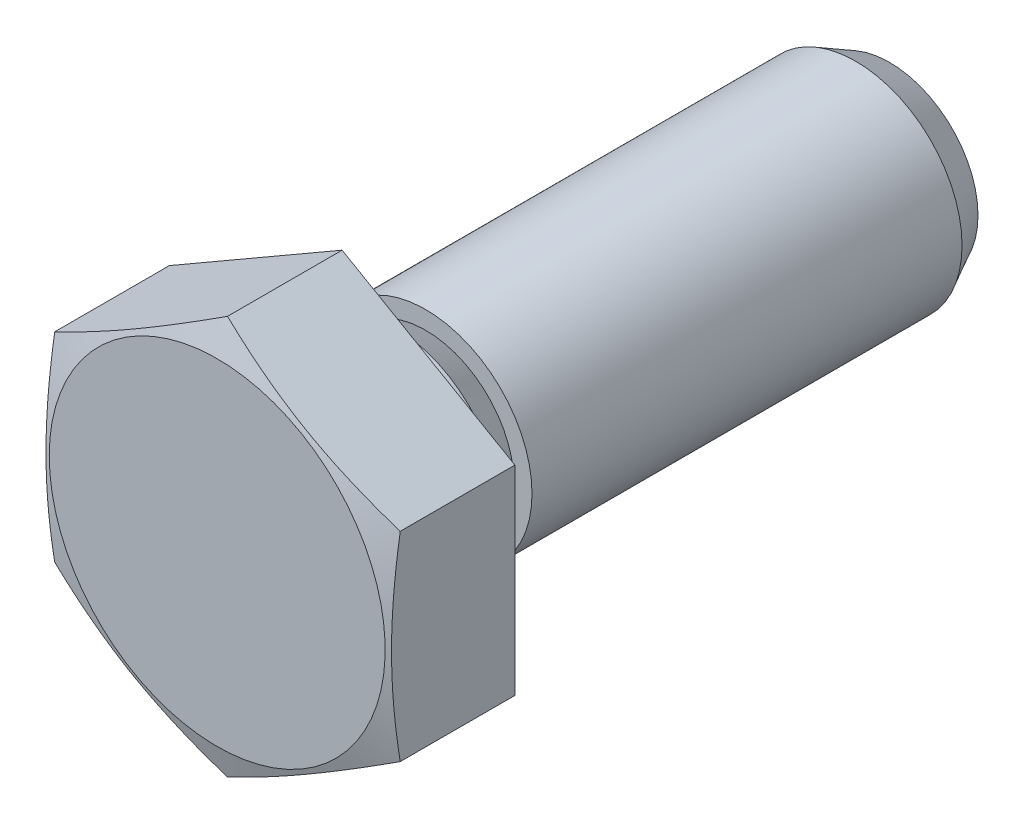
ISO-10303-21;
HEADER;
FILE_DESCRIPTION(('STEP AP214'),'2;1');
FILE_NAME('part.step','',(''),(''),'','','');
FILE_SCHEMA(('AUTOMOTIVE_DESIGN { 1 0 10303 214 1 1 1 1 }'));
ENDSEC;
DATA;
#1=APPLICATION_CONTEXT('core data for automotive mechanical design processes');
#2=APPLICATION_PROTOCOL_DEFINITION('international standard','automotive_design',2000,#1);
#3=PRODUCT_CONTEXT('',#1,'mechanical');
#4=PRODUCT('Part','Part','',(#3));
#5=PRODUCT_RELATED_PRODUCT_CATEGORY('part','',(#4));
#6=PRODUCT_DEFINITION_FORMATION('','',#4);
#7=PRODUCT_DEFINITION_CONTEXT('part definition',#1,'design');
#8=PRODUCT_DEFINITION('design','',#6,#7);
#9=PRODUCT_DEFINITION_SHAPE('','',#8);
#10=(LENGTH_UNIT() NAMED_UNIT(*) SI_UNIT(.MILLI.,.METRE.));
#11=(NAMED_UNIT(*) PLANE_ANGLE_UNIT() SI_UNIT($,.RADIAN.));
#12=(NAMED_UNIT(*) SI_UNIT($,.STERADIAN.) SOLID_ANGLE_UNIT());
#13=UNCERTAINTY_MEASURE_WITH_UNIT(LENGTH_MEASURE(1.E-05),#10,'distance_accuracy_value','');
#14=(GEOMETRIC_REPRESENTATION_CONTEXT(3) GLOBAL_UNCERTAINTY_ASSIGNED_CONTEXT((#13)) GLOBAL_UNIT_ASSIGNED_CONTEXT((#10,
#11,#12)) REPRESENTATION_CONTEXT('',''));
#15=CARTESIAN_POINT('',(0.,0.,0.));
#16=DIRECTION('',(0.,0.,1.));
#17=DIRECTION('',(1.,0.,0.));
#18=AXIS2_PLACEMENT_3D('',#15,#16,#17);
#19=CARTESIAN_POINT('',(0.,0.,0.600000000000003));
#20=DIRECTION('',(0.,0.,1.));
#21=DIRECTION('',(1.,0.,0.));
#22=AXIS2_PLACEMENT_3D('',#19,#20,#21);
#23=TOROIDAL_SURFACE('',#22,5.1,0.6);
#24=CARTESIAN_POINT('',(0.,0.,0.600000000000003));
#25=DIRECTION('',(0.,0.,1.));
#26=DIRECTION('',(1.,0.,0.));
#27=AXIS2_PLACEMENT_3D('',#24,#25,#26);
#28=CIRCLE('',#27,5.7);
#29=CARTESIAN_POINT('',(5.70000000000002,0.,0.600000000000004));
#30=VERTEX_POINT('',#29);
#31=EDGE_CURVE('E11',#30,#30,#28,.T.);
#32=ORIENTED_EDGE('',*,*,#31,.F.);
#33=EDGE_LOOP('',(#32));
#34=FACE_BOUND('',#33,.T.);
#35=CARTESIAN_POINT('',(0.,0.,0.));
#36=DIRECTION('',(0.,0.,1.));
#37=DIRECTION('',(1.,0.,0.));
#38=AXIS2_PLACEMENT_3D('',#35,#36,#37);
#39=CIRCLE('',#38,5.1);
#40=CARTESIAN_POINT('',(5.10000000000002,0.,0.));
#41=VERTEX_POINT('',#40);
#42=EDGE_CURVE('E23',#41,#41,#39,.T.);
#43=ORIENTED_EDGE('',*,*,#42,.T.);
#44=EDGE_LOOP('',(#43));
#45=FACE_BOUND('',#44,.T.);
#46=ADVANCED_FACE('F16',(#34,#45),#23,.T.);
#47=CARTESIAN_POINT('',(0.,5.09999999999991,0.));
#48=DIRECTION('',(0.,0.,-1.));
#49=DIRECTION('',(-1.,0.,0.));
#50=AXIS2_PLACEMENT_3D('',#47,#48,#49);
#51=PLANE('',#50);
#52=CARTESIAN_POINT('',(0.,0.,0.));
#53=DIRECTION('',(0.,0.,1.));
#54=DIRECTION('',(1.,0.,0.));
#55=AXIS2_PLACEMENT_3D('',#52,#53,#54);
#56=CIRCLE('',#55,4.4);
#57=CARTESIAN_POINT('',(4.40000000000002,0.,0.));
#58=VERTEX_POINT('',#57);
#59=EDGE_CURVE('E117',#58,#58,#56,.T.);
#60=ORIENTED_EDGE('',*,*,#59,.T.);
#61=EDGE_LOOP('',(#60));
#62=FACE_BOUND('',#61,.T.);
#63=ORIENTED_EDGE('',*,*,#42,.F.);
#64=EDGE_LOOP('',(#63));
#65=FACE_BOUND('',#64,.T.);
#66=ADVANCED_FACE('F123',(#62,#65),#51,.T.);
#67=CARTESIAN_POINT('',(0.,0.,-0.399999999999998));
#68=DIRECTION('',(0.,0.,1.));
#69=DIRECTION('',(1.,0.,0.));
#70=AXIS2_PLACEMENT_3D('',#67,#68,#69);
#71=TOROIDAL_SURFACE('',#70,4.4,0.4);
#72=CARTESIAN_POINT('',(0.,0.,-0.399999999999998));
#73=DIRECTION('',(0.,0.,1.));
#74=DIRECTION('',(1.,0.,0.));
#75=AXIS2_PLACEMENT_3D('',#72,#73,#74);
#76=CIRCLE('',#75,4.);
#77=CARTESIAN_POINT('',(4.00000000000001,0.,-0.399999999999997));
#78=VERTEX_POINT('',#77);
#79=EDGE_CURVE('E114',#78,#78,#76,.T.);
#80=ORIENTED_EDGE('',*,*,#79,.T.);
#81=EDGE_LOOP('',(#80));
#82=FACE_BOUND('',#81,.T.);
#83=ORIENTED_EDGE('',*,*,#59,.F.);
#84=EDGE_LOOP('',(#83));
#85=FACE_BOUND('',#84,.T.);
#86=ADVANCED_FACE('F125',(#82,#85),#71,.F.);
#87=CARTESIAN_POINT('',(0.,0.,0.600000000000003));
#88=DIRECTION('',(0.,0.,1.));
#89=DIRECTION('',(1.,0.,0.));
#90=AXIS2_PLACEMENT_3D('',#87,#88,#89);
#91=CYLINDRICAL_SURFACE('',#90,4.);
#92=CARTESIAN_POINT('',(0.,0.,-1.37215937550418));
#93=DIRECTION('',(0.,0.,1.));
#94=DIRECTION('',(1.,0.,0.));
#95=AXIS2_PLACEMENT_3D('',#92,#93,#94);
#96=CIRCLE('',#95,4.);
#97=CARTESIAN_POINT('',(4.00000000000001,0.,-1.37215937550418));
#98=VERTEX_POINT('',#97);
#99=EDGE_CURVE('E111',#98,#98,#96,.T.);
#100=ORIENTED_EDGE('',*,*,#99,.T.);
#101=EDGE_LOOP('',(#100));
#102=FACE_BOUND('',#101,.T.);
#103=ORIENTED_EDGE('',*,*,#79,.F.);
#104=EDGE_LOOP('',(#103));
#105=FACE_BOUND('',#104,.T.);
#106=ADVANCED_FACE('F132',(#102,#105),#91,.T.);
#107=CARTESIAN_POINT('',(0.,0.,-1.37215937550418));
#108=DIRECTION('',(0.,0.,1.));
#109=DIRECTION('',(1.,0.,0.));
#110=AXIS2_PLACEMENT_3D('',#107,#108,#109);
#111=CONICAL_SURFACE('',#110,4.,0.523598775598299);
#112=CARTESIAN_POINT('',(0.,0.,-2.544));
#113=DIRECTION('',(0.,0.,1.));
#114=DIRECTION('',(1.,0.,0.));
#115=AXIS2_PLACEMENT_3D('',#112,#113,#114);
#116=CIRCLE('',#115,3.3234375);
#117=CARTESIAN_POINT('',(3.32343750000001,0.,-2.544));
#118=VERTEX_POINT('',#117);
#119=EDGE_CURVE('E108',#118,#118,#116,.T.);
#120=ORIENTED_EDGE('',*,*,#119,.T.);
#121=EDGE_LOOP('',(#120));
#122=FACE_BOUND('',#121,.T.);
#123=ORIENTED_EDGE('',*,*,#99,.F.);
#124=EDGE_LOOP('',(#123));
#125=FACE_BOUND('',#124,.T.);
#126=ADVANCED_FACE('F139',(#122,#125),#111,.T.);
#127=CARTESIAN_POINT('',(0.,3.32343749999991,-2.54399999999999));
#128=DIRECTION('',(0.,0.,1.));
#129=DIRECTION('',(1.,0.,0.));
#130=AXIS2_PLACEMENT_3D('',#127,#128,#129);
#131=PLANE('',#130);
#132=CARTESIAN_POINT('',(0.,0.,-2.544));
#133=DIRECTION('',(0.,0.,1.));
#134=DIRECTION('',(1.,0.,0.));
#135=AXIS2_PLACEMENT_3D('',#132,#133,#134);
#136=CIRCLE('',#135,4.);
#137=CARTESIAN_POINT('',(4.00000000000001,0.,-2.544));
#138=VERTEX_POINT('',#137);
#139=EDGE_CURVE('E105',#138,#138,#136,.T.);
#140=ORIENTED_EDGE('',*,*,#139,.T.);
#141=EDGE_LOOP('',(#140));
#142=FACE_BOUND('',#141,.T.);
#143=ORIENTED_EDGE('',*,*,#119,.F.);
#144=EDGE_LOOP('',(#143));
#145=FACE_BOUND('',#144,.T.);
#146=ADVANCED_FACE('F143',(#142,#145),#131,.T.);
#147=CARTESIAN_POINT('',(0.,0.,0.600000000000003));
#148=DIRECTION('',(0.,0.,1.));
#149=DIRECTION('',(1.,0.,0.));
#150=AXIS2_PLACEMENT_3D('',#147,#148,#149);
#151=CYLINDRICAL_SURFACE('',#150,4.);
#152=CARTESIAN_POINT('',(0.,0.,-18.7234375));
#153=DIRECTION('',(0.,0.,1.));
#154=DIRECTION('',(1.,0.,0.));
#155=AXIS2_PLACEMENT_3D('',#152,#153,#154);
#156=CIRCLE('',#155,4.);
#157=CARTESIAN_POINT('',(4.00000000000002,0.,-18.7234375));
#158=VERTEX_POINT('',#157);
#159=EDGE_CURVE('E102',#158,#158,#156,.T.);
#160=ORIENTED_EDGE('',*,*,#159,.T.);
#161=EDGE_LOOP('',(#160));
#162=FACE_BOUND('',#161,.T.);
#163=ORIENTED_EDGE('',*,*,#139,.F.);
#164=EDGE_LOOP('',(#163));
#165=FACE_BOUND('',#164,.T.);
#166=ADVANCED_FACE('F147',(#162,#165),#151,.T.);
#167=CARTESIAN_POINT('',(0.,0.,-18.7234375));
#168=DIRECTION('',(0.,0.,1.));
#169=DIRECTION('',(1.,0.,0.));
#170=AXIS2_PLACEMENT_3D('',#167,#168,#169);
#171=CONICAL_SURFACE('',#170,4.,0.487349023752149);
#172=CARTESIAN_POINT('',(0.,0.,-20.));
#173=DIRECTION('',(0.,0.,1.));
#174=DIRECTION('',(1.,0.,0.));
#175=AXIS2_PLACEMENT_3D('',#172,#173,#174);
#176=CIRCLE('',#175,3.3234375);
#177=CARTESIAN_POINT('',(3.32343750000002,0.,-20.));
#178=VERTEX_POINT('',#177);
#179=EDGE_CURVE('E99',#178,#178,#176,.T.);
#180=ORIENTED_EDGE('',*,*,#179,.T.);
#181=EDGE_LOOP('',(#180));
#182=FACE_BOUND('',#181,.T.);
#183=ORIENTED_EDGE('',*,*,#159,.F.);
#184=EDGE_LOOP('',(#183));
#185=FACE_BOUND('',#184,.T.);
#186=ADVANCED_FACE('F151',(#182,#185),#171,.T.);
#187=CARTESIAN_POINT('',(0.,3.32343749999989,-20.));
#188=DIRECTION('',(0.,0.,-1.));
#189=DIRECTION('',(-1.,0.,0.));
#190=AXIS2_PLACEMENT_3D('',#187,#188,#189);
#191=PLANE('',#190);
#192=ORIENTED_EDGE('',*,*,#179,.F.);
#193=EDGE_LOOP('',(#192));
#194=FACE_BOUND('',#193,.T.);
#195=ADVANCED_FACE('F155',(#194),#191,.T.);
#196=CARTESIAN_POINT('',(-6.50000000000004,-3.75277500000006,0.600000000000003));
#197=DIRECTION('',(0.,0.,-1.));
#198=DIRECTION('',(-1.,0.,0.));
#199=AXIS2_PLACEMENT_3D('',#196,#197,#198);
#200=PLANE('',#199);
#201=DIRECTION('',(0.,-1.,0.));
#202=VECTOR('',#201,1.);
#203=CARTESIAN_POINT('',(-6.5,3.75277499999991,0.6));
#204=LINE('',#203,#202);
#205=CARTESIAN_POINT('',(-6.5,3.75277499999991,0.6));
#206=VERTEX_POINT('',#205);
#207=CARTESIAN_POINT('',(-6.50000000000004,-3.75277500000006,0.600000000000003));
#208=VERTEX_POINT('',#207);
#209=EDGE_CURVE('E82',#206,#208,#204,.T.);
#210=ORIENTED_EDGE('',*,*,#209,.F.);
#211=DIRECTION('',(0.866025504730547,0.499999825156183,0.));
#212=VECTOR('',#211,1.);
#213=CARTESIAN_POINT('',(-6.5,3.75277499999991,0.6));
#214=LINE('',#213,#212);
#215=CARTESIAN_POINT('',(0.,7.50554999999993,0.600000000000003));
#216=VERTEX_POINT('',#215);
#217=EDGE_CURVE('E87',#206,#216,#214,.T.);
#218=ORIENTED_EDGE('',*,*,#217,.T.);
#219=DIRECTION('',(0.866025504730546,-0.499999825156179,0.));
#220=VECTOR('',#219,1.);
#221=CARTESIAN_POINT('',(0.,7.50554999999993,0.600000000000003));
#222=LINE('',#221,#220);
#223=CARTESIAN_POINT('',(6.5,3.75277499999993,0.6));
#224=VERTEX_POINT('',#223);
#225=EDGE_CURVE('E93',#216,#224,#222,.T.);
#226=ORIENTED_EDGE('',*,*,#225,.T.);
#227=DIRECTION('',(0.,-1.,0.));
#228=VECTOR('',#227,1.);
#229=CARTESIAN_POINT('',(6.5,3.75277499999993,0.6));
#230=LINE('',#229,#228);
#231=CARTESIAN_POINT('',(6.49999999999998,-3.75277500000007,0.600000000000003));
#232=VERTEX_POINT('',#231);
#233=EDGE_CURVE('E251',#224,#232,#230,.T.);
#234=ORIENTED_EDGE('',*,*,#233,.T.);
#235=DIRECTION('',(-0.866025504730547,-0.499999825156183,0.));
#236=VECTOR('',#235,1.);
#237=CARTESIAN_POINT('',(6.49999999999998,-3.75277500000007,0.600000000000003));
#238=LINE('',#237,#236);
#239=CARTESIAN_POINT('',(0.,-7.50555,0.599999999999986));
#240=VERTEX_POINT('',#239);
#241=EDGE_CURVE('E237',#232,#240,#238,.T.);
#242=ORIENTED_EDGE('',*,*,#241,.T.);
#243=DIRECTION('',(-0.866025504730546,0.499999825156179,0.));
#244=VECTOR('',#243,1.);
#245=CARTESIAN_POINT('',(0.,-7.50555,0.599999999999986));
#246=LINE('',#245,#244);
#247=EDGE_CURVE('E235',#240,#208,#246,.T.);
#248=ORIENTED_EDGE('',*,*,#247,.T.);
#249=EDGE_LOOP('',(#210,#218,#226,#234,#242,#248));
#250=FACE_BOUND('',#249,.T.);
#251=ORIENTED_EDGE('',*,*,#31,.T.);
#252=EDGE_LOOP('',(#251));
#253=FACE_BOUND('',#252,.T.);
#254=ADVANCED_FACE('F159',(#250,#253),#200,.T.);
#255=CARTESIAN_POINT('',(-6.5,3.75277499999991,0.6));
#256=DIRECTION('',(-1.,0.,0.));
#257=DIRECTION('',(0.,0.,1.));
#258=AXIS2_PLACEMENT_3D('',#255,#256,#257);
#259=PLANE('',#258);
#260=CARTESIAN_POINT('',(-6.50000000000001,4.38981818494441,4.80301736463262));
#261=CARTESIAN_POINT('',(-6.5,4.09098114342369,4.85753275079676));
#262=CARTESIAN_POINT('',(-6.5,3.79142042130079,4.90839258808937));
#263=CARTESIAN_POINT('',(-6.5,3.19074376500434,5.00106933028275));
#264=CARTESIAN_POINT('',(-6.5,2.88962706721284,5.04288125458366));
#265=CARTESIAN_POINT('',(-6.5,2.28634005695621,5.11563270113123));
#266=CARTESIAN_POINT('',(-6.5,1.98417098743661,5.14658231625703));
#267=CARTESIAN_POINT('',(-6.5,1.3788561021359,5.19600650415045));
#268=CARTESIAN_POINT('',(-6.5,1.07571049052056,5.21448353352638));
#269=CARTESIAN_POINT('',(-6.49999999999999,0.473199008770008,5.23765885872422));
#270=CARTESIAN_POINT('',(-6.49999999999999,0.173840678298242,5.24254932180709));
#271=CARTESIAN_POINT('',(-6.49999999999999,-0.424803474354412,5.23878261833517));
#272=CARTESIAN_POINT('',(-6.5,-0.724089292337838,5.23012479782684));
#273=CARTESIAN_POINT('',(-6.49999999999999,-1.32190400676999,5.19982341760308));
#274=CARTESIAN_POINT('',(-6.49999999999998,-1.62043309408229,5.1781835473559));
#275=CARTESIAN_POINT('',(-6.5,-2.21639634341066,5.12318405474636));
#276=CARTESIAN_POINT('',(-6.50000000000004,-2.51383048306589,5.08982419436712));
#277=CARTESIAN_POINT('',(-6.50000000000004,-3.10949215568242,5.01274668329356));
#278=CARTESIAN_POINT('',(-6.5,-3.4077102110653,4.96895683780598));
#279=CARTESIAN_POINT('',(-6.49999999999997,-4.00275973674118,4.87287774511329));
#280=CARTESIAN_POINT('',(-6.49999999999998,-4.29959119837215,4.82058844488517));
#281=CARTESIAN_POINT('',(-6.49999999999999,-4.89215745803702,4.70904950246267));
#282=CARTESIAN_POINT('',(-6.49999999999998,-5.18789129168956,4.6497947817472));
#283=CARTESIAN_POINT('',(-6.49999999999998,-5.77818646616312,4.52569811905164));
#284=CARTESIAN_POINT('',(-6.49999999999998,-6.07274776867464,4.46085599605961));
#285=CARTESIAN_POINT('',(-6.49999999999998,-6.6657527725892,4.32556160106893));
#286=CARTESIAN_POINT('',(-6.49999999999998,-6.96417913620018,4.25503370972697));
#287=CARTESIAN_POINT('',(-6.49999999999998,-7.56012687426723,4.11024969500433));
#288=CARTESIAN_POINT('',(-6.49999999999998,-7.85764823653338,4.03599352163925));
#289=CARTESIAN_POINT('',(-6.49999999999998,-8.45129351350843,3.88463909044816));
#290=CARTESIAN_POINT('',(-6.49999999999997,-8.74741905327487,3.80754718346771));
#291=CARTESIAN_POINT('',(-6.49999999999998,-9.3390016036609,3.65091210276321));
#292=CARTESIAN_POINT('',(-6.5,-9.634458655897,3.57136908640607));
#293=CARTESIAN_POINT('',(-6.50000000000004,-9.92964867617219,3.4908647884395));
#294=B_SPLINE_CURVE_WITH_KNOTS('',3,(#260,#261,#262,#263,#264,#265,#266,#267,#268,#269,#270,
#271,#272,#273,#274,#275,#276,#277,#278,#279,#280,#281,#282,#283,#284,#285,#286,#287,#288,#289,
#290,#291,#292,#293),.UNSPECIFIED.,.F.,.F.,(4,2,2,2,2,2,2,2,2,2,2,2,2,2,2,2,4),(0.,
0.911367958894645,1.82323632898969,2.73425516558879,3.6450945149493,4.54298379874906,
5.44091642353601,6.33859397877664,7.23628976566708,8.14038972633079,9.0444953273507,
9.94926425309646,10.8540625011612,11.7739744723412,12.6938987799058,13.6118752114491,
14.5297928290637),.UNSPECIFIED.);
#295=CARTESIAN_POINT('',(-6.5,3.75277499999989,4.91320410232518));
#296=VERTEX_POINT('',#295);
#297=CARTESIAN_POINT('',(-6.50000000000004,-3.75277500000006,4.91320410232518));
#298=VERTEX_POINT('',#297);
#299=EDGE_CURVE('E71',#296,#298,#294,.T.);
#300=ORIENTED_EDGE('',*,*,#299,.F.);
#301=DIRECTION('',(0.,0.,1.));
#302=VECTOR('',#301,1.);
#303=CARTESIAN_POINT('',(-6.5,3.75277499999991,0.6));
#304=LINE('',#303,#302);
#305=EDGE_CURVE('E80',#206,#296,#304,.T.);
#306=ORIENTED_EDGE('',*,*,#305,.F.);
#307=ORIENTED_EDGE('',*,*,#209,.T.);
#308=DIRECTION('',(0.,0.,1.));
#309=VECTOR('',#308,1.);
#310=CARTESIAN_POINT('',(-6.50000000000004,-3.75277500000006,0.600000000000003));
#311=LINE('',#310,#309);
#312=EDGE_CURVE('E38',#208,#298,#311,.T.);
#313=ORIENTED_EDGE('',*,*,#312,.T.);
#314=EDGE_LOOP('',(#300,#306,#307,#313));
#315=FACE_BOUND('',#314,.T.);
#316=ADVANCED_FACE('F78',(#315),#259,.T.);
#317=CARTESIAN_POINT('',(0.,-7.50555,0.599999999999986));
#318=DIRECTION('',(0.499999825156183,0.866025504730547,0.));
#319=DIRECTION('',(0.866025504730546,-0.499999825156179,0.));
#320=AXIS2_PLACEMENT_3D('',#317,#318,#319);
#321=PLANE('',#320);
#322=DIRECTION('',(0.,0.,1.));
#323=VECTOR('',#322,1.);
#324=CARTESIAN_POINT('',(0.,-7.50555,0.599999999999986));
#325=LINE('',#324,#323);
#326=CARTESIAN_POINT('',(0.,-7.50555,4.91320495806605));
#327=VERTEX_POINT('',#326);
#328=EDGE_CURVE('E242',#240,#327,#325,.T.);
#329=ORIENTED_EDGE('',*,*,#328,.T.);
#330=CARTESIAN_POINT('',(1.99999947159135E-07,-7.50555011546999,4.91320492041747));
#331=CARTESIAN_POINT('',(-0.269500655237232,-7.34995379669882,4.96395435620913));
#332=CARTESIAN_POINT('',(-0.539719061359576,-7.19394319992409,5.01007955239316));
#333=CARTESIAN_POINT('',(-1.08156698166692,-6.88110730313464,5.09118099754311));
#334=CARTESIAN_POINT('',(-1.35319726131547,-6.72428156117955,5.12615037417004));
#335=CARTESIAN_POINT('',(-1.89544179463619,-6.41121667986684,5.18275634044609));
#336=CARTESIAN_POINT('',(-2.16604804790681,-6.25498215954104,5.20449237434749));
#337=CARTESIAN_POINT('',(-2.70776966260387,-5.94221918529569,5.23364290566883));
#338=CARTESIAN_POINT('',(-2.97888485043205,-5.78569083160309,5.24106162309442));
#339=CARTESIAN_POINT('',(-3.52111522308335,-5.47263412595287,5.24106153932641));
#340=CARTESIAN_POINT('',(-3.79223040790647,-5.31610577399524,5.23364273820097));
#341=CARTESIAN_POINT('',(-4.33395201362326,-5.00334280493465,5.20449204536534));
#342=CARTESIAN_POINT('',(-4.60455826091762,-4.84710828805925,5.18275593364779));
#343=CARTESIAN_POINT('',(-5.1468027805067,-4.53404341467449,5.12614982107048));
#344=CARTESIAN_POINT('',(-5.41843305238488,-4.37721767720562,5.09118037602759));
#345=CARTESIAN_POINT('',(-5.96028095609197,-4.06438179000034,5.01007880517865));
#346=CARTESIAN_POINT('',(-6.23049935338636,-3.90837119832244,4.96395355171785));
#347=CARTESIAN_POINT('',(-6.50000020000005,-3.75277488453007,4.91320406467657));
#348=B_SPLINE_CURVE_WITH_KNOTS('',3,(#330,#331,#332,#333,#334,#335,#336,#337,#338,#339,#340,
#341,#342,#343,#344,#345,#346,#347),.UNSPECIFIED.,.F.,.F.,(4,2,2,2,2,2,2,2,4),(0.,
0.945987329444461,1.89255629680093,2.83192136456474,3.77100951369683,4.71009765851462,
5.64946272218884,6.59603168593694,7.54201901067135),.UNSPECIFIED.);
#349=EDGE_CURVE('E83',#327,#298,#348,.T.);
#350=ORIENTED_EDGE('',*,*,#349,.T.);
#351=ORIENTED_EDGE('',*,*,#312,.F.);
#352=ORIENTED_EDGE('',*,*,#247,.F.);
#353=EDGE_LOOP('',(#329,#350,#351,#352));
#354=FACE_BOUND('',#353,.T.);
#355=ADVANCED_FACE('F164',(#354),#321,.F.);
#356=CARTESIAN_POINT('',(6.49999999999998,-3.75277500000007,0.600000000000003));
#357=DIRECTION('',(-0.499999825156179,0.866025504730546,0.));
#358=DIRECTION('',(0.866025504730547,0.499999825156183,0.));
#359=AXIS2_PLACEMENT_3D('',#356,#357,#358);
#360=PLANE('',#359);
#361=DIRECTION('',(0.,0.,1.));
#362=VECTOR('',#361,1.);
#363=CARTESIAN_POINT('',(6.49999999999998,-3.75277500000007,0.600000000000003));
#364=LINE('',#363,#362);
#365=CARTESIAN_POINT('',(6.50000000000001,-3.75277500000004,4.91320410232518));
#366=VERTEX_POINT('',#365);
#367=EDGE_CURVE('E245',#232,#366,#364,.T.);
#368=ORIENTED_EDGE('',*,*,#367,.T.);
#369=CARTESIAN_POINT('',(6.5000002,-3.75277488453003,4.91320406467657));
#370=CARTESIAN_POINT('',(6.23049935338633,-3.90837119832245,4.96395355171784));
#371=CARTESIAN_POINT('',(5.96028095609196,-4.06438179000037,5.01007880517865));
#372=CARTESIAN_POINT('',(5.41843305238486,-4.37721767720566,5.09118037602759));
#373=CARTESIAN_POINT('',(5.14680278050668,-4.53404341467453,5.12614982107048));
#374=CARTESIAN_POINT('',(4.6045582609176,-4.84710828805928,5.18275593364779));
#375=CARTESIAN_POINT('',(4.33395201362323,-5.00334280493469,5.20449204536534));
#376=CARTESIAN_POINT('',(3.79223040790643,-5.31610577399527,5.23364273820097));
#377=CARTESIAN_POINT('',(3.52111522308331,-5.47263412595291,5.2410615393264));
#378=CARTESIAN_POINT('',(2.97888485043201,-5.78569083160313,5.24106162309441));
#379=CARTESIAN_POINT('',(2.70776966260383,-5.94221918529573,5.23364290566882));
#380=CARTESIAN_POINT('',(2.16604804790676,-6.25498215954109,5.20449237434748));
#381=CARTESIAN_POINT('',(1.89544179463614,-6.41121667986688,5.18275634044609));
#382=CARTESIAN_POINT('',(1.35319726131542,-6.7242815611796,5.12615037417003));
#383=CARTESIAN_POINT('',(1.08156698166687,-6.88110730313469,5.09118099754309));
#384=CARTESIAN_POINT('',(0.53971906135951,-7.19394319992413,5.01007955239315));
#385=CARTESIAN_POINT('',(0.269500655237156,-7.34995379669885,4.96395435620912));
#386=CARTESIAN_POINT('',(-2.0000004430365E-07,-7.50555011546999,4.91320492041747));
#387=B_SPLINE_CURVE_WITH_KNOTS('',3,(#369,#370,#371,#372,#373,#374,#375,#376,#377,#378,#379,
#380,#381,#382,#383,#384,#385,#386),.UNSPECIFIED.,.F.,.F.,(4,2,2,2,2,2,2,2,4),(0.,
0.945987324734409,1.89255628848252,2.83192135215675,3.77100949697455,4.71009764610665,
5.64946271387047,6.59603168122694,7.54201901067141),.UNSPECIFIED.);
#388=EDGE_CURVE('E207',#366,#327,#387,.T.);
#389=ORIENTED_EDGE('',*,*,#388,.T.);
#390=ORIENTED_EDGE('',*,*,#328,.F.);
#391=ORIENTED_EDGE('',*,*,#241,.F.);
#392=EDGE_LOOP('',(#368,#389,#390,#391));
#393=FACE_BOUND('',#392,.T.);
#394=ADVANCED_FACE('F213',(#393),#360,.F.);
#395=CARTESIAN_POINT('',(6.5,3.75277499999993,0.6));
#396=DIRECTION('',(-1.,0.,0.));
#397=DIRECTION('',(0.,0.,1.));
#398=AXIS2_PLACEMENT_3D('',#395,#396,#397);
#399=PLANE('',#398);
#400=DIRECTION('',(0.,0.,1.));
#401=VECTOR('',#400,1.);
#402=CARTESIAN_POINT('',(6.5,3.75277499999993,0.6));
#403=LINE('',#402,#401);
#404=CARTESIAN_POINT('',(6.5,3.75277499999991,4.91320410232518));
#405=VERTEX_POINT('',#404);
#406=EDGE_CURVE('E91',#224,#405,#403,.T.);
#407=ORIENTED_EDGE('',*,*,#406,.T.);
#408=CARTESIAN_POINT('',(6.49999999999999,4.38981818494443,4.80301736463262));
#409=CARTESIAN_POINT('',(6.5,4.09098114342371,4.85753275079676));
#410=CARTESIAN_POINT('',(6.5,3.7914204213008,4.90839258808937));
#411=CARTESIAN_POINT('',(6.5,3.19074376500436,5.00106933028274));
#412=CARTESIAN_POINT('',(6.5,2.88962706721286,5.04288125458366));
#413=CARTESIAN_POINT('',(6.5,2.28634005695622,5.11563270113122));
#414=CARTESIAN_POINT('',(6.50000000000001,1.98417098743662,5.14658231625703));
#415=CARTESIAN_POINT('',(6.50000000000001,1.3788561021359,5.19600650415045));
#416=CARTESIAN_POINT('',(6.50000000000001,1.07571049052056,5.21448353352638));
#417=CARTESIAN_POINT('',(6.50000000000001,0.47319900877001,5.23765885872421));
#418=CARTESIAN_POINT('',(6.50000000000001,0.173840678298244,5.24254932180709));
#419=CARTESIAN_POINT('',(6.50000000000001,-0.424803474354413,5.23878261833517));
#420=CARTESIAN_POINT('',(6.50000000000001,-0.72408929233784,5.23012479782684));
#421=CARTESIAN_POINT('',(6.50000000000001,-1.32190400677,5.19982341760307));
#422=CARTESIAN_POINT('',(6.50000000000002,-1.62043309408229,5.17818354735589));
#423=CARTESIAN_POINT('',(6.50000000000001,-2.21639634341067,5.12318405474636));
#424=CARTESIAN_POINT('',(6.49999999999999,-2.5138304830659,5.08982419436712));
#425=CARTESIAN_POINT('',(6.49999999999999,-3.10949215568243,5.01274668329356));
#426=CARTESIAN_POINT('',(6.50000000000001,-3.40771021106531,4.96895683780597));
#427=CARTESIAN_POINT('',(6.50000000000002,-4.00275973674118,4.87287774511328));
#428=CARTESIAN_POINT('',(6.50000000000002,-4.29959119837215,4.82058844488516));
#429=CARTESIAN_POINT('',(6.50000000000002,-4.89215745803702,4.70904950246267));
#430=CARTESIAN_POINT('',(6.50000000000002,-5.18789129168955,4.64979478174719));
#431=CARTESIAN_POINT('',(6.50000000000002,-5.77818646616311,4.52569811905163));
#432=CARTESIAN_POINT('',(6.50000000000002,-6.07274776867463,4.46085599605961));
#433=CARTESIAN_POINT('',(6.50000000000002,-6.66575277258919,4.32556160106892));
#434=CARTESIAN_POINT('',(6.50000000000002,-6.96417913620016,4.25503370972697));
#435=CARTESIAN_POINT('',(6.50000000000002,-7.56012687426722,4.11024969500433));
#436=CARTESIAN_POINT('',(6.50000000000002,-7.85764823653337,4.03599352163925));
#437=CARTESIAN_POINT('',(6.50000000000003,-8.45129351350841,3.88463909044816));
#438=CARTESIAN_POINT('',(6.50000000000003,-8.74741905327485,3.80754718346771));
#439=CARTESIAN_POINT('',(6.50000000000002,-9.33900160366088,3.6509121027632));
#440=CARTESIAN_POINT('',(6.5,-9.63445865589698,3.57136908640607));
#441=CARTESIAN_POINT('',(6.49999999999995,-9.92964867617216,3.4908647884395));
#442=B_SPLINE_CURVE_WITH_KNOTS('',3,(#408,#409,#410,#411,#412,#413,#414,#415,#416,#417,#418,
#419,#420,#421,#422,#423,#424,#425,#426,#427,#428,#429,#430,#431,#432,#433,#434,#435,#436,#437,
#438,#439,#440,#441),.UNSPECIFIED.,.F.,.F.,(4,2,2,2,2,2,2,2,2,2,2,2,2,2,2,2,4),(0.,
0.911367958894648,1.8232363289897,2.73425516558881,3.64509451494931,4.54298379874908,
5.44091642353604,6.33859397877667,7.23628976566711,8.14038972633081,9.04449532735072,
9.94926425309647,10.8540625011613,11.7739744723412,12.6938987799058,13.6118752114491,
14.5297928290637),.UNSPECIFIED.);
#443=EDGE_CURVE('E201',#405,#366,#442,.T.);
#444=ORIENTED_EDGE('',*,*,#443,.T.);
#445=ORIENTED_EDGE('',*,*,#367,.F.);
#446=ORIENTED_EDGE('',*,*,#233,.F.);
#447=EDGE_LOOP('',(#407,#444,#445,#446));
#448=FACE_BOUND('',#447,.T.);
#449=ADVANCED_FACE('F216',(#448),#399,.F.);
#450=CARTESIAN_POINT('',(0.,7.50554999999993,0.600000000000003));
#451=DIRECTION('',(-0.499999825156183,-0.866025504730547,0.));
#452=DIRECTION('',(-0.866025504730546,0.499999825156179,0.));
#453=AXIS2_PLACEMENT_3D('',#450,#451,#452);
#454=PLANE('',#453);
#455=DIRECTION('',(0.,0.,1.));
#456=VECTOR('',#455,1.);
#457=CARTESIAN_POINT('',(0.,7.50554999999993,0.600000000000003));
#458=LINE('',#457,#456);
#459=CARTESIAN_POINT('',(0.,7.50554999999991,4.91320495806602));
#460=VERTEX_POINT('',#459);
#461=EDGE_CURVE('E89',#216,#460,#458,.T.);
#462=ORIENTED_EDGE('',*,*,#461,.T.);
#463=CARTESIAN_POINT('',(-1.99999961036923E-07,7.50555011546991,4.91320492041747));
#464=CARTESIAN_POINT('',(0.269500655237217,7.34995379669874,4.96395435620915));
#465=CARTESIAN_POINT('',(0.539719061359561,7.19394319992401,5.01007955239318));
#466=CARTESIAN_POINT('',(1.08156698166691,6.88110730313457,5.09118099754314));
#467=CARTESIAN_POINT('',(1.35319726131546,6.72428156117947,5.12615037417007));
#468=CARTESIAN_POINT('',(1.89544179463618,6.41121667986675,5.18275634044612));
#469=CARTESIAN_POINT('',(2.1660480479068,6.25498215954096,5.20449237434752));
#470=CARTESIAN_POINT('',(2.70776966260386,5.94221918529561,5.23364290566885));
#471=CARTESIAN_POINT('',(2.97888485043204,5.78569083160301,5.24106162309444));
#472=CARTESIAN_POINT('',(3.52111522308334,5.47263412595278,5.24106153932643));
#473=CARTESIAN_POINT('',(3.79223040790646,5.31610577399515,5.23364273820099));
#474=CARTESIAN_POINT('',(4.33395201362325,5.00334280493456,5.20449204536536));
#475=CARTESIAN_POINT('',(4.60455826091762,4.84710828805916,5.18275593364781));
#476=CARTESIAN_POINT('',(5.1468027805067,4.53404341467441,5.1261498210705));
#477=CARTESIAN_POINT('',(5.41843305238488,4.37721767720554,5.09118037602761));
#478=CARTESIAN_POINT('',(5.96028095609197,4.06438179000025,5.01007880517867));
#479=CARTESIAN_POINT('',(6.23049935338634,3.90837119832233,4.96395355171785));
#480=CARTESIAN_POINT('',(6.5000002,3.75277488452991,4.91320406467657));
#481=B_SPLINE_CURVE_WITH_KNOTS('',3,(#463,#464,#465,#466,#467,#468,#469,#470,#471,#472,#473,
#474,#475,#476,#477,#478,#479,#480),.UNSPECIFIED.,.F.,.F.,(4,2,2,2,2,2,2,2,4),(0.,
0.945987329444464,1.89255629680093,2.83192136456475,3.77100951369684,4.71009765851464,
5.64946272218886,6.59603168593696,7.54201901067137),.UNSPECIFIED.);
#482=EDGE_CURVE('E30',#460,#405,#481,.T.);
#483=ORIENTED_EDGE('',*,*,#482,.T.);
#484=ORIENTED_EDGE('',*,*,#406,.F.);
#485=ORIENTED_EDGE('',*,*,#225,.F.);
#486=EDGE_LOOP('',(#462,#483,#484,#485));
#487=FACE_BOUND('',#486,.T.);
#488=ADVANCED_FACE('F220',(#487),#454,.F.);
#489=CARTESIAN_POINT('',(-6.5,3.75277499999991,0.6));
#490=DIRECTION('',(0.499999825156179,-0.866025504730546,0.));
#491=DIRECTION('',(-0.866025504730547,-0.499999825156183,0.));
#492=AXIS2_PLACEMENT_3D('',#489,#490,#491);
#493=PLANE('',#492);
#494=ORIENTED_EDGE('',*,*,#305,.T.);
#495=CARTESIAN_POINT('',(-6.5000002,3.75277488452989,4.91320406467657));
#496=CARTESIAN_POINT('',(-6.23049935338633,3.9083711983223,4.96395355171786));
#497=CARTESIAN_POINT('',(-5.96028095609195,4.06438179000022,5.01007880517867));
#498=CARTESIAN_POINT('',(-5.41843305238486,4.37721767720551,5.09118037602762));
#499=CARTESIAN_POINT('',(-5.14680278050667,4.53404341467438,5.12614982107051));
#500=CARTESIAN_POINT('',(-4.60455826091759,4.84710828805914,5.18275593364783));
#501=CARTESIAN_POINT('',(-4.33395201362322,5.00334280493454,5.20449204536537));
#502=CARTESIAN_POINT('',(-3.79223040790642,5.31610577399513,5.23364273820101));
#503=CARTESIAN_POINT('',(-3.5211152230833,5.47263412595276,5.24106153932644));
#504=CARTESIAN_POINT('',(-2.97888485043199,5.78569083160299,5.24106162309445));
#505=CARTESIAN_POINT('',(-2.70776966260381,5.94221918529559,5.23364290566886));
#506=CARTESIAN_POINT('',(-2.16604804790674,6.25498215954094,5.20449237434753));
#507=CARTESIAN_POINT('',(-1.89544179463612,6.41121667986674,5.18275634044613));
#508=CARTESIAN_POINT('',(-1.3531972613154,6.72428156117945,5.12615037417008));
#509=CARTESIAN_POINT('',(-1.08156698166684,6.88110730313455,5.09118099754315));
#510=CARTESIAN_POINT('',(-0.53971906135949,7.193943199924,5.01007955239319));
#511=CARTESIAN_POINT('',(-0.269500655237145,7.34995379669873,4.96395435620915));
#512=CARTESIAN_POINT('',(2.00000030425862E-07,7.50555011546991,4.91320492041747));
#513=B_SPLINE_CURVE_WITH_KNOTS('',3,(#495,#496,#497,#498,#499,#500,#501,#502,#503,#504,#505,
#506,#507,#508,#509,#510,#511,#512),.UNSPECIFIED.,.F.,.F.,(4,2,2,2,2,2,2,2,4),(0.,
0.945987324734412,1.89255628848253,2.83192135215676,3.77100949697456,4.71009764610666,
5.64946271387049,6.59603168122696,7.54201901067144),.UNSPECIFIED.);
#514=EDGE_CURVE('E67',#296,#460,#513,.T.);
#515=ORIENTED_EDGE('',*,*,#514,.T.);
#516=ORIENTED_EDGE('',*,*,#461,.F.);
#517=ORIENTED_EDGE('',*,*,#217,.F.);
#518=EDGE_LOOP('',(#494,#515,#516,#517));
#519=FACE_BOUND('',#518,.T.);
#520=ADVANCED_FACE('F85',(#519),#493,.F.);
#521=CARTESIAN_POINT('',(0.,0.,4.86426181818182));
#522=DIRECTION('',(0.,0.,-1.));
#523=DIRECTION('',(-1.,0.,0.));
#524=AXIS2_PLACEMENT_3D('',#521,#522,#523);
#525=CONICAL_SURFACE('',#524,7.655661,1.25561835384484);
#526=ORIENTED_EDGE('',*,*,#299,.T.);
#527=ORIENTED_EDGE('',*,*,#349,.F.);
#528=ORIENTED_EDGE('',*,*,#388,.F.);
#529=ORIENTED_EDGE('',*,*,#443,.F.);
#530=ORIENTED_EDGE('',*,*,#482,.F.);
#531=ORIENTED_EDGE('',*,*,#514,.F.);
#532=EDGE_LOOP('',(#526,#527,#528,#529,#530,#531));
#533=FACE_BOUND('',#532,.T.);
#534=CARTESIAN_POINT('',(0.,0.,5.3));
#535=DIRECTION('',(0.,0.,-1.));
#536=DIRECTION('',(-1.,0.,0.));
#537=AXIS2_PLACEMENT_3D('',#534,#535,#536);
#538=CIRCLE('',#537,6.319230718542);
#539=CARTESIAN_POINT('',(-6.31923071854202,0.,5.3));
#540=VERTEX_POINT('',#539);
#541=EDGE_CURVE('E75',#540,#540,#538,.F.);
#542=ORIENTED_EDGE('',*,*,#541,.F.);
#543=EDGE_LOOP('',(#542));
#544=FACE_BOUND('',#543,.T.);
#545=ADVANCED_FACE('F69',(#533,#544),#525,.T.);
#546=CARTESIAN_POINT('',(-6.50000000000004,-3.75277500000003,5.3));
#547=DIRECTION('',(0.,0.,-1.));
#548=DIRECTION('',(-1.,0.,0.));
#549=AXIS2_PLACEMENT_3D('',#546,#547,#548);
#550=PLANE('',#549);
#551=ORIENTED_EDGE('',*,*,#541,.T.);
#552=EDGE_LOOP('',(#551));
#553=FACE_BOUND('',#552,.T.);
#554=ADVANCED_FACE('F182',(#553),#550,.F.);
#555=CLOSED_SHELL('',(#46,#66,#86,#106,#126,#146,#166,#186,#195,#254,#316,#355,#394,#449,#488,
#520,#545,#554));
#556=MANIFOLD_SOLID_BREP('B1',#555);
#557=ADVANCED_BREP_SHAPE_REPRESENTATION('',(#18,#556),#14);
#558=SHAPE_DEFINITION_REPRESENTATION(#9,#557);
ENDSEC;
END-ISO-10303-21;
